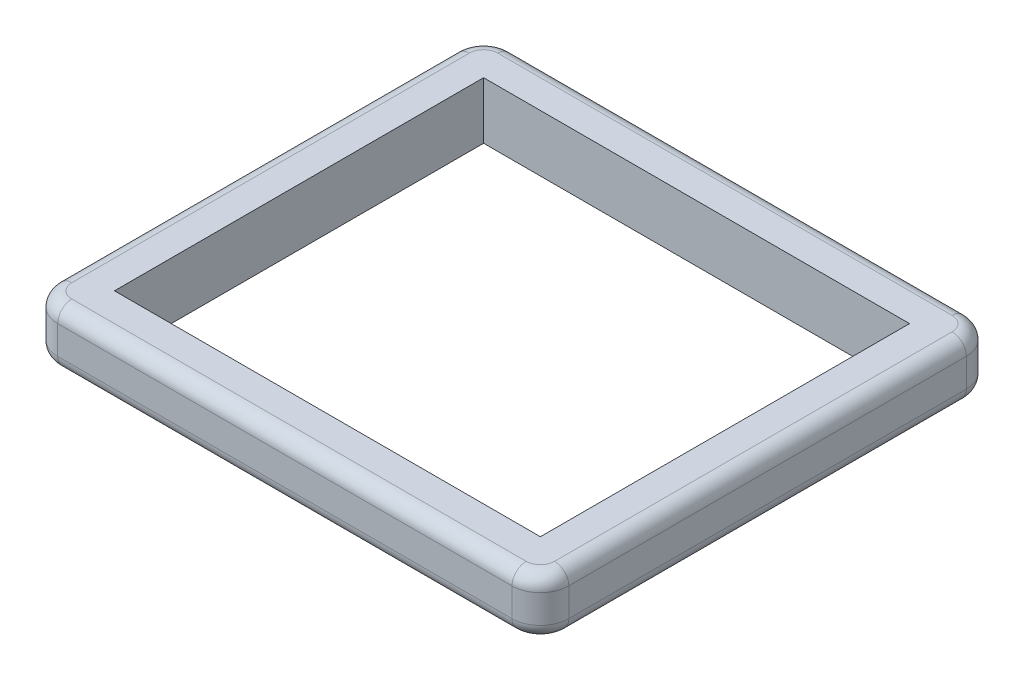
ISO-10303-21;
HEADER;
FILE_DESCRIPTION(('STEP AP214'),'2;1');
FILE_NAME('part.step','',(''),(''),'','','');
FILE_SCHEMA(('AUTOMOTIVE_DESIGN { 1 0 10303 214 1 1 1 1 }'));
ENDSEC;
DATA;
#1=APPLICATION_CONTEXT('core data for automotive mechanical design processes');
#2=APPLICATION_PROTOCOL_DEFINITION('international standard','automotive_design',2000,#1);
#3=PRODUCT_CONTEXT('',#1,'mechanical');
#4=PRODUCT('Part','Part','',(#3));
#5=PRODUCT_RELATED_PRODUCT_CATEGORY('part','',(#4));
#6=PRODUCT_DEFINITION_FORMATION('','',#4);
#7=PRODUCT_DEFINITION_CONTEXT('part definition',#1,'design');
#8=PRODUCT_DEFINITION('design','',#6,#7);
#9=PRODUCT_DEFINITION_SHAPE('','',#8);
#10=(LENGTH_UNIT() NAMED_UNIT(*) SI_UNIT(.MILLI.,.METRE.));
#11=(NAMED_UNIT(*) PLANE_ANGLE_UNIT() SI_UNIT($,.RADIAN.));
#12=(NAMED_UNIT(*) SI_UNIT($,.STERADIAN.) SOLID_ANGLE_UNIT());
#13=UNCERTAINTY_MEASURE_WITH_UNIT(LENGTH_MEASURE(1.E-05),#10,'distance_accuracy_value','');
#14=(GEOMETRIC_REPRESENTATION_CONTEXT(3) GLOBAL_UNCERTAINTY_ASSIGNED_CONTEXT((#13)) GLOBAL_UNIT_ASSIGNED_CONTEXT((#10,
#11,#12)) REPRESENTATION_CONTEXT('',''));
#15=CARTESIAN_POINT('',(0.,0.,0.));
#16=DIRECTION('',(0.,0.,1.));
#17=DIRECTION('',(1.,0.,0.));
#18=AXIS2_PLACEMENT_3D('',#15,#16,#17);
#19=CARTESIAN_POINT('',(0.,101.6,0.));
#20=DIRECTION('',(0.,1.,0.));
#21=DIRECTION('',(0.,0.,1.));
#22=AXIS2_PLACEMENT_3D('',#19,#20,#21);
#23=PLANE('',#22);
#24=DIRECTION('',(1.,0.,0.));
#25=VECTOR('',#24,1.);
#26=CARTESIAN_POINT('',(0.,101.6,0.));
#27=LINE('',#26,#25);
#28=CARTESIAN_POINT('',(0.,101.6,0.));
#29=VERTEX_POINT('',#28);
#30=CARTESIAN_POINT('',(762.,101.6,0.));
#31=VERTEX_POINT('',#30);
#32=EDGE_CURVE('E187',#29,#31,#27,.T.);
#33=ORIENTED_EDGE('',*,*,#32,.F.);
#34=DIRECTION('',(0.,0.,1.));
#35=VECTOR('',#34,1.);
#36=CARTESIAN_POINT('',(0.,101.6,0.));
#37=LINE('',#36,#35);
#38=CARTESIAN_POINT('',(-2.22044604925031E-13,101.6,-660.4));
#39=VERTEX_POINT('',#38);
#40=EDGE_CURVE('E177',#39,#29,#37,.T.);
#41=ORIENTED_EDGE('',*,*,#40,.F.);
#42=DIRECTION('',(-1.,0.,0.));
#43=VECTOR('',#42,1.);
#44=CARTESIAN_POINT('',(-2.22044604925031E-13,101.6,-660.4));
#45=LINE('',#44,#43);
#46=CARTESIAN_POINT('',(762.,101.6,-660.4));
#47=VERTEX_POINT('',#46);
#48=EDGE_CURVE('E203',#47,#39,#45,.T.);
#49=ORIENTED_EDGE('',*,*,#48,.F.);
#50=DIRECTION('',(0.,0.,-1.));
#51=VECTOR('',#50,1.);
#52=CARTESIAN_POINT('',(762.,101.6,0.));
#53=LINE('',#52,#51);
#54=EDGE_CURVE('E201',#31,#47,#53,.T.);
#55=ORIENTED_EDGE('',*,*,#54,.F.);
#56=EDGE_LOOP('',(#33,#41,#49,#55));
#57=FACE_BOUND('',#56,.T.);
#58=CARTESIAN_POINT('',(787.4,101.6,25.4));
#59=DIRECTION('',(0.,1.,0.));
#60=DIRECTION('',(0.,0.,1.));
#61=AXIS2_PLACEMENT_3D('',#58,#59,#60);
#62=CIRCLE('',#61,25.4);
#63=CARTESIAN_POINT('',(812.8,101.6,25.4));
#64=VERTEX_POINT('',#63);
#65=CARTESIAN_POINT('',(787.4,101.6,50.8));
#66=VERTEX_POINT('',#65);
#67=EDGE_CURVE('E288',#64,#66,#62,.F.);
#68=ORIENTED_EDGE('',*,*,#67,.F.);
#69=DIRECTION('',(0.,0.,-1.));
#70=VECTOR('',#69,1.);
#71=CARTESIAN_POINT('',(812.8,101.6,-736.6));
#72=LINE('',#71,#70);
#73=CARTESIAN_POINT('',(812.8,101.6,-685.8));
#74=VERTEX_POINT('',#73);
#75=EDGE_CURVE('E225',#64,#74,#72,.T.);
#76=ORIENTED_EDGE('',*,*,#75,.T.);
#77=CARTESIAN_POINT('',(787.4,101.6,-685.8));
#78=DIRECTION('',(0.,1.,0.));
#79=DIRECTION('',(0.,0.,1.));
#80=AXIS2_PLACEMENT_3D('',#77,#78,#79);
#81=CIRCLE('',#80,25.4);
#82=CARTESIAN_POINT('',(787.4,101.6,-711.2));
#83=VERTEX_POINT('',#82);
#84=EDGE_CURVE('E285',#83,#74,#81,.F.);
#85=ORIENTED_EDGE('',*,*,#84,.F.);
#86=DIRECTION('',(-1.,0.,0.));
#87=VECTOR('',#86,1.);
#88=CARTESIAN_POINT('',(-76.2,101.6,-711.2));
#89=LINE('',#88,#87);
#90=CARTESIAN_POINT('',(-25.4,101.6,-711.2));
#91=VERTEX_POINT('',#90);
#92=EDGE_CURVE('E222',#83,#91,#89,.T.);
#93=ORIENTED_EDGE('',*,*,#92,.T.);
#94=CARTESIAN_POINT('',(-25.4,101.6,-685.8));
#95=DIRECTION('',(0.,1.,0.));
#96=DIRECTION('',(0.,0.,1.));
#97=AXIS2_PLACEMENT_3D('',#94,#95,#96);
#98=CIRCLE('',#97,25.4);
#99=CARTESIAN_POINT('',(-50.8,101.6,-685.8));
#100=VERTEX_POINT('',#99);
#101=EDGE_CURVE('E279',#100,#91,#98,.F.);
#102=ORIENTED_EDGE('',*,*,#101,.F.);
#103=DIRECTION('',(0.,0.,1.));
#104=VECTOR('',#103,1.);
#105=CARTESIAN_POINT('',(-50.8,101.6,76.2));
#106=LINE('',#105,#104);
#107=CARTESIAN_POINT('',(-50.8,101.6,25.4));
#108=VERTEX_POINT('',#107);
#109=EDGE_CURVE('E195',#100,#108,#106,.T.);
#110=ORIENTED_EDGE('',*,*,#109,.T.);
#111=CARTESIAN_POINT('',(-25.4,101.6,25.4));
#112=DIRECTION('',(0.,1.,0.));
#113=DIRECTION('',(0.,0.,1.));
#114=AXIS2_PLACEMENT_3D('',#111,#112,#113);
#115=CIRCLE('',#114,25.4);
#116=CARTESIAN_POINT('',(-25.4,101.6,50.8));
#117=VERTEX_POINT('',#116);
#118=EDGE_CURVE('E282',#117,#108,#115,.F.);
#119=ORIENTED_EDGE('',*,*,#118,.F.);
#120=DIRECTION('',(1.,0.,0.));
#121=VECTOR('',#120,1.);
#122=CARTESIAN_POINT('',(838.2,101.6,50.8));
#123=LINE('',#122,#121);
#124=EDGE_CURVE('E228',#117,#66,#123,.T.);
#125=ORIENTED_EDGE('',*,*,#124,.T.);
#126=EDGE_LOOP('',(#68,#76,#85,#93,#102,#110,#119,#125));
#127=FACE_BOUND('',#126,.T.);
#128=ADVANCED_FACE('F36',(#57,#127),#23,.T.);
#129=CARTESIAN_POINT('',(0.,0.,0.));
#130=DIRECTION('',(0.,1.,0.));
#131=DIRECTION('',(0.,0.,1.));
#132=AXIS2_PLACEMENT_3D('',#129,#130,#131);
#133=PLANE('',#132);
#134=DIRECTION('',(0.,0.,1.));
#135=VECTOR('',#134,1.);
#136=CARTESIAN_POINT('',(0.,0.,0.));
#137=LINE('',#136,#135);
#138=CARTESIAN_POINT('',(-2.22044604925031E-13,0.,-660.4));
#139=VERTEX_POINT('',#138);
#140=CARTESIAN_POINT('',(0.,0.,0.));
#141=VERTEX_POINT('',#140);
#142=EDGE_CURVE('E207',#139,#141,#137,.T.);
#143=ORIENTED_EDGE('',*,*,#142,.T.);
#144=DIRECTION('',(1.,0.,0.));
#145=VECTOR('',#144,1.);
#146=CARTESIAN_POINT('',(0.,0.,0.));
#147=LINE('',#146,#145);
#148=CARTESIAN_POINT('',(762.,0.,0.));
#149=VERTEX_POINT('',#148);
#150=EDGE_CURVE('E194',#141,#149,#147,.T.);
#151=ORIENTED_EDGE('',*,*,#150,.T.);
#152=DIRECTION('',(0.,0.,-1.));
#153=VECTOR('',#152,1.);
#154=CARTESIAN_POINT('',(762.,0.,0.));
#155=LINE('',#154,#153);
#156=CARTESIAN_POINT('',(762.,0.,-660.4));
#157=VERTEX_POINT('',#156);
#158=EDGE_CURVE('E211',#149,#157,#155,.T.);
#159=ORIENTED_EDGE('',*,*,#158,.T.);
#160=DIRECTION('',(-1.,0.,0.));
#161=VECTOR('',#160,1.);
#162=CARTESIAN_POINT('',(-2.22044604925031E-13,0.,-660.4));
#163=LINE('',#162,#161);
#164=EDGE_CURVE('E188',#157,#139,#163,.T.);
#165=ORIENTED_EDGE('',*,*,#164,.T.);
#166=EDGE_LOOP('',(#143,#151,#159,#165));
#167=FACE_BOUND('',#166,.T.);
#168=CARTESIAN_POINT('',(787.4,0.,25.4));
#169=DIRECTION('',(0.,1.,0.));
#170=DIRECTION('',(0.,0.,1.));
#171=AXIS2_PLACEMENT_3D('',#168,#169,#170);
#172=CIRCLE('',#171,25.4);
#173=CARTESIAN_POINT('',(787.4,0.,50.8));
#174=VERTEX_POINT('',#173);
#175=CARTESIAN_POINT('',(812.8,0.,25.4));
#176=VERTEX_POINT('',#175);
#177=EDGE_CURVE('E272',#174,#176,#172,.T.);
#178=ORIENTED_EDGE('',*,*,#177,.F.);
#179=DIRECTION('',(1.,0.,0.));
#180=VECTOR('',#179,1.);
#181=CARTESIAN_POINT('',(0.,0.,50.8));
#182=LINE('',#181,#180);
#183=CARTESIAN_POINT('',(-25.4,0.,50.8));
#184=VERTEX_POINT('',#183);
#185=EDGE_CURVE('E247',#174,#184,#182,.F.);
#186=ORIENTED_EDGE('',*,*,#185,.T.);
#187=CARTESIAN_POINT('',(-25.4,0.,25.4));
#188=DIRECTION('',(0.,1.,0.));
#189=DIRECTION('',(0.,0.,1.));
#190=AXIS2_PLACEMENT_3D('',#187,#188,#189);
#191=CIRCLE('',#190,25.4);
#192=CARTESIAN_POINT('',(-50.8,0.,25.4));
#193=VERTEX_POINT('',#192);
#194=EDGE_CURVE('E267',#193,#184,#191,.T.);
#195=ORIENTED_EDGE('',*,*,#194,.F.);
#196=DIRECTION('',(0.,0.,1.));
#197=VECTOR('',#196,1.);
#198=CARTESIAN_POINT('',(-50.8,0.,0.));
#199=LINE('',#198,#197);
#200=CARTESIAN_POINT('',(-50.8,0.,-685.8));
#201=VERTEX_POINT('',#200);
#202=EDGE_CURVE('E250',#193,#201,#199,.F.);
#203=ORIENTED_EDGE('',*,*,#202,.T.);
#204=CARTESIAN_POINT('',(-25.4,0.,-685.8));
#205=DIRECTION('',(0.,1.,0.));
#206=DIRECTION('',(0.,0.,1.));
#207=AXIS2_PLACEMENT_3D('',#204,#205,#206);
#208=CIRCLE('',#207,25.4);
#209=CARTESIAN_POINT('',(-25.4,0.,-711.2));
#210=VERTEX_POINT('',#209);
#211=EDGE_CURVE('E265',#210,#201,#208,.T.);
#212=ORIENTED_EDGE('',*,*,#211,.F.);
#213=DIRECTION('',(-1.,0.,0.));
#214=VECTOR('',#213,1.);
#215=CARTESIAN_POINT('',(0.,0.,-711.2));
#216=LINE('',#215,#214);
#217=CARTESIAN_POINT('',(787.4,0.,-711.2));
#218=VERTEX_POINT('',#217);
#219=EDGE_CURVE('E253',#210,#218,#216,.F.);
#220=ORIENTED_EDGE('',*,*,#219,.T.);
#221=CARTESIAN_POINT('',(787.4,0.,-685.8));
#222=DIRECTION('',(0.,1.,0.));
#223=DIRECTION('',(0.,0.,1.));
#224=AXIS2_PLACEMENT_3D('',#221,#222,#223);
#225=CIRCLE('',#224,25.4);
#226=CARTESIAN_POINT('',(812.8,0.,-685.8));
#227=VERTEX_POINT('',#226);
#228=EDGE_CURVE('E269',#227,#218,#225,.T.);
#229=ORIENTED_EDGE('',*,*,#228,.F.);
#230=DIRECTION('',(0.,0.,-1.));
#231=VECTOR('',#230,1.);
#232=CARTESIAN_POINT('',(812.8,0.,0.));
#233=LINE('',#232,#231);
#234=EDGE_CURVE('E244',#227,#176,#233,.F.);
#235=ORIENTED_EDGE('',*,*,#234,.T.);
#236=EDGE_LOOP('',(#178,#186,#195,#203,#212,#220,#229,#235));
#237=FACE_BOUND('',#236,.T.);
#238=ADVANCED_FACE('F388',(#167,#237),#133,.F.);
#239=CARTESIAN_POINT('',(-76.2,101.6,76.2));
#240=DIRECTION('',(0.,0.,-1.));
#241=DIRECTION('',(-1.,0.,0.));
#242=AXIS2_PLACEMENT_3D('',#239,#240,#241);
#243=PLANE('',#242);
#244=DIRECTION('',(1.,0.,0.));
#245=VECTOR('',#244,1.);
#246=CARTESIAN_POINT('',(-76.2,76.2,76.2));
#247=LINE('',#246,#245);
#248=CARTESIAN_POINT('',(787.4,76.2,76.2));
#249=VERTEX_POINT('',#248);
#250=CARTESIAN_POINT('',(-25.4,76.2,76.2));
#251=VERTEX_POINT('',#250);
#252=EDGE_CURVE('E231',#249,#251,#247,.F.);
#253=ORIENTED_EDGE('',*,*,#252,.T.);
#254=DIRECTION('',(0.,-1.,0.));
#255=VECTOR('',#254,1.);
#256=CARTESIAN_POINT('',(-25.4,101.6,76.2));
#257=LINE('',#256,#255);
#258=CARTESIAN_POINT('',(-25.4,25.4,76.2));
#259=VERTEX_POINT('',#258);
#260=EDGE_CURVE('E329',#251,#259,#257,.T.);
#261=ORIENTED_EDGE('',*,*,#260,.T.);
#262=DIRECTION('',(1.,0.,0.));
#263=VECTOR('',#262,1.);
#264=CARTESIAN_POINT('',(-76.2,25.4,76.2));
#265=LINE('',#264,#263);
#266=CARTESIAN_POINT('',(787.4,25.4,76.2));
#267=VERTEX_POINT('',#266);
#268=EDGE_CURVE('E259',#259,#267,#265,.T.);
#269=ORIENTED_EDGE('',*,*,#268,.T.);
#270=DIRECTION('',(0.,-1.,0.));
#271=VECTOR('',#270,1.);
#272=CARTESIAN_POINT('',(787.4,101.6,76.2));
#273=LINE('',#272,#271);
#274=EDGE_CURVE('E327',#267,#249,#273,.F.);
#275=ORIENTED_EDGE('',*,*,#274,.T.);
#276=EDGE_LOOP('',(#253,#261,#269,#275));
#277=FACE_BOUND('',#276,.T.);
#278=ADVANCED_FACE('F453',(#277),#243,.F.);
#279=CARTESIAN_POINT('',(838.2,101.6,76.2));
#280=DIRECTION('',(-1.,0.,0.));
#281=DIRECTION('',(0.,0.,1.));
#282=AXIS2_PLACEMENT_3D('',#279,#280,#281);
#283=PLANE('',#282);
#284=DIRECTION('',(0.,0.,-1.));
#285=VECTOR('',#284,1.);
#286=CARTESIAN_POINT('',(838.2,25.4,76.2));
#287=LINE('',#286,#285);
#288=CARTESIAN_POINT('',(838.2,25.4,25.4));
#289=VERTEX_POINT('',#288);
#290=CARTESIAN_POINT('',(838.2,25.4,-685.8));
#291=VERTEX_POINT('',#290);
#292=EDGE_CURVE('E262',#289,#291,#287,.T.);
#293=ORIENTED_EDGE('',*,*,#292,.T.);
#294=DIRECTION('',(0.,-1.,0.));
#295=VECTOR('',#294,1.);
#296=CARTESIAN_POINT('',(838.2,101.6,-685.8));
#297=LINE('',#296,#295);
#298=CARTESIAN_POINT('',(838.2,76.2,-685.8));
#299=VERTEX_POINT('',#298);
#300=EDGE_CURVE('E11',#291,#299,#297,.F.);
#301=ORIENTED_EDGE('',*,*,#300,.T.);
#302=DIRECTION('',(0.,0.,-1.));
#303=VECTOR('',#302,1.);
#304=CARTESIAN_POINT('',(838.2,76.2,76.2));
#305=LINE('',#304,#303);
#306=CARTESIAN_POINT('',(838.2,76.2,25.4));
#307=VERTEX_POINT('',#306);
#308=EDGE_CURVE('E234',#299,#307,#305,.F.);
#309=ORIENTED_EDGE('',*,*,#308,.T.);
#310=DIRECTION('',(0.,-1.,0.));
#311=VECTOR('',#310,1.);
#312=CARTESIAN_POINT('',(838.2,101.6,25.4));
#313=LINE('',#312,#311);
#314=EDGE_CURVE('E45',#307,#289,#313,.T.);
#315=ORIENTED_EDGE('',*,*,#314,.T.);
#316=EDGE_LOOP('',(#293,#301,#309,#315));
#317=FACE_BOUND('',#316,.T.);
#318=ADVANCED_FACE('F429',(#317),#283,.F.);
#319=CARTESIAN_POINT('',(-76.2,101.6,-736.6));
#320=DIRECTION('',(0.,0.,1.));
#321=DIRECTION('',(1.,0.,0.));
#322=AXIS2_PLACEMENT_3D('',#319,#320,#321);
#323=PLANE('',#322);
#324=DIRECTION('',(-1.,0.,0.));
#325=VECTOR('',#324,1.);
#326=CARTESIAN_POINT('',(-76.2,25.4,-736.6));
#327=LINE('',#326,#325);
#328=CARTESIAN_POINT('',(787.4,25.4,-736.6));
#329=VERTEX_POINT('',#328);
#330=CARTESIAN_POINT('',(-25.4,25.4,-736.6));
#331=VERTEX_POINT('',#330);
#332=EDGE_CURVE('E242',#329,#331,#327,.T.);
#333=ORIENTED_EDGE('',*,*,#332,.T.);
#334=DIRECTION('',(0.,-1.,0.));
#335=VECTOR('',#334,1.);
#336=CARTESIAN_POINT('',(-25.4,101.6,-736.6));
#337=LINE('',#336,#335);
#338=CARTESIAN_POINT('',(-25.4,76.2,-736.6));
#339=VERTEX_POINT('',#338);
#340=EDGE_CURVE('E60',#331,#339,#337,.F.);
#341=ORIENTED_EDGE('',*,*,#340,.T.);
#342=DIRECTION('',(-1.,0.,0.));
#343=VECTOR('',#342,1.);
#344=CARTESIAN_POINT('',(838.2,76.2,-736.6));
#345=LINE('',#344,#343);
#346=CARTESIAN_POINT('',(787.4,76.2,-736.6));
#347=VERTEX_POINT('',#346);
#348=EDGE_CURVE('E237',#339,#347,#345,.F.);
#349=ORIENTED_EDGE('',*,*,#348,.T.);
#350=DIRECTION('',(0.,-1.,0.));
#351=VECTOR('',#350,1.);
#352=CARTESIAN_POINT('',(787.4,101.6,-736.6));
#353=LINE('',#352,#351);
#354=EDGE_CURVE('E324',#347,#329,#353,.T.);
#355=ORIENTED_EDGE('',*,*,#354,.T.);
#356=EDGE_LOOP('',(#333,#341,#349,#355));
#357=FACE_BOUND('',#356,.T.);
#358=ADVANCED_FACE('F376',(#357),#323,.F.);
#359=CARTESIAN_POINT('',(-76.2,101.6,76.2));
#360=DIRECTION('',(1.,0.,0.));
#361=DIRECTION('',(0.,0.,-1.));
#362=AXIS2_PLACEMENT_3D('',#359,#360,#361);
#363=PLANE('',#362);
#364=DIRECTION('',(0.,0.,1.));
#365=VECTOR('',#364,1.);
#366=CARTESIAN_POINT('',(-76.2,76.2,-736.6));
#367=LINE('',#366,#365);
#368=CARTESIAN_POINT('',(-76.2,76.2,25.4));
#369=VERTEX_POINT('',#368);
#370=CARTESIAN_POINT('',(-76.2,76.2,-685.8));
#371=VERTEX_POINT('',#370);
#372=EDGE_CURVE('E239',#369,#371,#367,.F.);
#373=ORIENTED_EDGE('',*,*,#372,.T.);
#374=DIRECTION('',(0.,-1.,0.));
#375=VECTOR('',#374,1.);
#376=CARTESIAN_POINT('',(-76.2,101.6,-685.8));
#377=LINE('',#376,#375);
#378=CARTESIAN_POINT('',(-76.2,25.4,-685.8));
#379=VERTEX_POINT('',#378);
#380=EDGE_CURVE('E322',#371,#379,#377,.T.);
#381=ORIENTED_EDGE('',*,*,#380,.T.);
#382=DIRECTION('',(0.,0.,1.));
#383=VECTOR('',#382,1.);
#384=CARTESIAN_POINT('',(-76.2,25.4,76.2));
#385=LINE('',#384,#383);
#386=CARTESIAN_POINT('',(-76.2,25.4,25.4));
#387=VERTEX_POINT('',#386);
#388=EDGE_CURVE('E256',#379,#387,#385,.T.);
#389=ORIENTED_EDGE('',*,*,#388,.T.);
#390=DIRECTION('',(0.,-1.,0.));
#391=VECTOR('',#390,1.);
#392=CARTESIAN_POINT('',(-76.2,101.6,25.4));
#393=LINE('',#392,#391);
#394=EDGE_CURVE('E320',#387,#369,#393,.F.);
#395=ORIENTED_EDGE('',*,*,#394,.T.);
#396=EDGE_LOOP('',(#373,#381,#389,#395));
#397=FACE_BOUND('',#396,.T.);
#398=ADVANCED_FACE('F406',(#397),#363,.F.);
#399=CARTESIAN_POINT('',(0.,101.6,0.));
#400=DIRECTION('',(1.,0.,0.));
#401=DIRECTION('',(0.,0.,-1.));
#402=AXIS2_PLACEMENT_3D('',#399,#400,#401);
#403=PLANE('',#402);
#404=ORIENTED_EDGE('',*,*,#142,.F.);
#405=DIRECTION('',(0.,-1.,0.));
#406=VECTOR('',#405,1.);
#407=CARTESIAN_POINT('',(-2.22044604925031E-13,101.6,-660.4));
#408=LINE('',#407,#406);
#409=EDGE_CURVE('E183',#39,#139,#408,.T.);
#410=ORIENTED_EDGE('',*,*,#409,.F.);
#411=ORIENTED_EDGE('',*,*,#40,.T.);
#412=DIRECTION('',(0.,-1.,0.));
#413=VECTOR('',#412,1.);
#414=CARTESIAN_POINT('',(0.,101.6,0.));
#415=LINE('',#414,#413);
#416=EDGE_CURVE('E180',#29,#141,#415,.T.);
#417=ORIENTED_EDGE('',*,*,#416,.T.);
#418=EDGE_LOOP('',(#404,#410,#411,#417));
#419=FACE_BOUND('',#418,.T.);
#420=ADVANCED_FACE('F179',(#419),#403,.T.);
#421=CARTESIAN_POINT('',(0.,101.6,0.));
#422=DIRECTION('',(0.,0.,-1.));
#423=DIRECTION('',(-1.,0.,0.));
#424=AXIS2_PLACEMENT_3D('',#421,#422,#423);
#425=PLANE('',#424);
#426=ORIENTED_EDGE('',*,*,#150,.F.);
#427=ORIENTED_EDGE('',*,*,#416,.F.);
#428=ORIENTED_EDGE('',*,*,#32,.T.);
#429=DIRECTION('',(0.,-1.,0.));
#430=VECTOR('',#429,1.);
#431=CARTESIAN_POINT('',(762.,101.6,0.));
#432=LINE('',#431,#430);
#433=EDGE_CURVE('E196',#31,#149,#432,.T.);
#434=ORIENTED_EDGE('',*,*,#433,.T.);
#435=EDGE_LOOP('',(#426,#427,#428,#434));
#436=FACE_BOUND('',#435,.T.);
#437=ADVANCED_FACE('F191',(#436),#425,.T.);
#438=CARTESIAN_POINT('',(762.,101.6,0.));
#439=DIRECTION('',(-1.,0.,0.));
#440=DIRECTION('',(0.,0.,1.));
#441=AXIS2_PLACEMENT_3D('',#438,#439,#440);
#442=PLANE('',#441);
#443=ORIENTED_EDGE('',*,*,#158,.F.);
#444=ORIENTED_EDGE('',*,*,#433,.F.);
#445=ORIENTED_EDGE('',*,*,#54,.T.);
#446=DIRECTION('',(0.,-1.,0.));
#447=VECTOR('',#446,1.);
#448=CARTESIAN_POINT('',(762.,101.6,-660.4));
#449=LINE('',#448,#447);
#450=EDGE_CURVE('E217',#47,#157,#449,.T.);
#451=ORIENTED_EDGE('',*,*,#450,.T.);
#452=EDGE_LOOP('',(#443,#444,#445,#451));
#453=FACE_BOUND('',#452,.T.);
#454=ADVANCED_FACE('F648',(#453),#442,.T.);
#455=CARTESIAN_POINT('',(-2.22044604925031E-13,101.6,-660.4));
#456=DIRECTION('',(0.,0.,1.));
#457=DIRECTION('',(1.,0.,0.));
#458=AXIS2_PLACEMENT_3D('',#455,#456,#457);
#459=PLANE('',#458);
#460=ORIENTED_EDGE('',*,*,#164,.F.);
#461=ORIENTED_EDGE('',*,*,#450,.F.);
#462=ORIENTED_EDGE('',*,*,#48,.T.);
#463=ORIENTED_EDGE('',*,*,#409,.T.);
#464=EDGE_LOOP('',(#460,#461,#462,#463));
#465=FACE_BOUND('',#464,.T.);
#466=ADVANCED_FACE('F477',(#465),#459,.T.);
#467=CARTESIAN_POINT('',(0.,76.2,-711.2));
#468=DIRECTION('',(1.,0.,0.));
#469=DIRECTION('',(0.,0.,-1.));
#470=AXIS2_PLACEMENT_3D('',#467,#468,#469);
#471=CYLINDRICAL_SURFACE('',#470,25.4);
#472=ORIENTED_EDGE('',*,*,#348,.F.);
#473=CARTESIAN_POINT('',(-25.4,76.2,-711.2));
#474=DIRECTION('',(1.,0.,0.));
#475=DIRECTION('',(0.,0.,-1.));
#476=AXIS2_PLACEMENT_3D('',#473,#474,#475);
#477=CIRCLE('',#476,25.4);
#478=EDGE_CURVE('E318',#339,#91,#477,.T.);
#479=ORIENTED_EDGE('',*,*,#478,.T.);
#480=ORIENTED_EDGE('',*,*,#92,.F.);
#481=CARTESIAN_POINT('',(787.4,76.2,-711.2));
#482=DIRECTION('',(-1.,0.,0.));
#483=DIRECTION('',(0.,0.,1.));
#484=AXIS2_PLACEMENT_3D('',#481,#482,#483);
#485=CIRCLE('',#484,25.4);
#486=EDGE_CURVE('E53',#83,#347,#485,.T.);
#487=ORIENTED_EDGE('',*,*,#486,.T.);
#488=EDGE_LOOP('',(#472,#479,#480,#487));
#489=FACE_BOUND('',#488,.T.);
#490=ADVANCED_FACE('F362',(#489),#471,.T.);
#491=CARTESIAN_POINT('',(-50.8,76.2,0.));
#492=DIRECTION('',(0.,0.,-1.));
#493=DIRECTION('',(-1.,0.,0.));
#494=AXIS2_PLACEMENT_3D('',#491,#492,#493);
#495=CYLINDRICAL_SURFACE('',#494,25.4);
#496=ORIENTED_EDGE('',*,*,#372,.F.);
#497=CARTESIAN_POINT('',(-50.8,76.2,25.4));
#498=DIRECTION('',(0.,0.,-1.));
#499=DIRECTION('',(-1.,0.,0.));
#500=AXIS2_PLACEMENT_3D('',#497,#498,#499);
#501=CIRCLE('',#500,25.4);
#502=EDGE_CURVE('E310',#369,#108,#501,.T.);
#503=ORIENTED_EDGE('',*,*,#502,.T.);
#504=ORIENTED_EDGE('',*,*,#109,.F.);
#505=CARTESIAN_POINT('',(-50.8,76.2,-685.8));
#506=DIRECTION('',(0.,0.,1.));
#507=DIRECTION('',(1.,0.,0.));
#508=AXIS2_PLACEMENT_3D('',#505,#506,#507);
#509=CIRCLE('',#508,25.4);
#510=EDGE_CURVE('E308',#100,#371,#509,.T.);
#511=ORIENTED_EDGE('',*,*,#510,.T.);
#512=EDGE_LOOP('',(#496,#503,#504,#511));
#513=FACE_BOUND('',#512,.T.);
#514=ADVANCED_FACE('F409',(#513),#495,.T.);
#515=CARTESIAN_POINT('',(812.8,76.2,0.));
#516=DIRECTION('',(0.,0.,1.));
#517=DIRECTION('',(1.,0.,0.));
#518=AXIS2_PLACEMENT_3D('',#515,#516,#517);
#519=CYLINDRICAL_SURFACE('',#518,25.4);
#520=ORIENTED_EDGE('',*,*,#308,.F.);
#521=CARTESIAN_POINT('',(812.8,76.2,-685.8));
#522=DIRECTION('',(0.,0.,1.));
#523=DIRECTION('',(1.,0.,0.));
#524=AXIS2_PLACEMENT_3D('',#521,#522,#523);
#525=CIRCLE('',#524,25.4);
#526=EDGE_CURVE('E301',#299,#74,#525,.T.);
#527=ORIENTED_EDGE('',*,*,#526,.T.);
#528=ORIENTED_EDGE('',*,*,#75,.F.);
#529=CARTESIAN_POINT('',(812.8,76.2,25.4));
#530=DIRECTION('',(0.,0.,-1.));
#531=DIRECTION('',(-1.,0.,0.));
#532=AXIS2_PLACEMENT_3D('',#529,#530,#531);
#533=CIRCLE('',#532,25.4);
#534=EDGE_CURVE('E299',#64,#307,#533,.T.);
#535=ORIENTED_EDGE('',*,*,#534,.T.);
#536=EDGE_LOOP('',(#520,#527,#528,#535));
#537=FACE_BOUND('',#536,.T.);
#538=ADVANCED_FACE('F469',(#537),#519,.T.);
#539=CARTESIAN_POINT('',(0.,76.2,50.8));
#540=DIRECTION('',(-1.,0.,0.));
#541=DIRECTION('',(0.,0.,1.));
#542=AXIS2_PLACEMENT_3D('',#539,#540,#541);
#543=CYLINDRICAL_SURFACE('',#542,25.4);
#544=ORIENTED_EDGE('',*,*,#252,.F.);
#545=CARTESIAN_POINT('',(787.4,76.2,50.8));
#546=DIRECTION('',(-1.,0.,0.));
#547=DIRECTION('',(0.,0.,1.));
#548=AXIS2_PLACEMENT_3D('',#545,#546,#547);
#549=CIRCLE('',#548,25.4);
#550=EDGE_CURVE('E293',#249,#66,#549,.T.);
#551=ORIENTED_EDGE('',*,*,#550,.T.);
#552=ORIENTED_EDGE('',*,*,#124,.F.);
#553=CARTESIAN_POINT('',(-25.4,76.2,50.8));
#554=DIRECTION('',(1.,0.,0.));
#555=DIRECTION('',(0.,0.,-1.));
#556=AXIS2_PLACEMENT_3D('',#553,#554,#555);
#557=CIRCLE('',#556,25.4);
#558=EDGE_CURVE('E291',#117,#251,#557,.T.);
#559=ORIENTED_EDGE('',*,*,#558,.T.);
#560=EDGE_LOOP('',(#544,#551,#552,#559));
#561=FACE_BOUND('',#560,.T.);
#562=ADVANCED_FACE('F416',(#561),#543,.T.);
#563=CARTESIAN_POINT('',(-76.2,25.4,50.8));
#564=DIRECTION('',(1.,0.,0.));
#565=DIRECTION('',(0.,0.,-1.));
#566=AXIS2_PLACEMENT_3D('',#563,#564,#565);
#567=CYLINDRICAL_SURFACE('',#566,25.4);
#568=ORIENTED_EDGE('',*,*,#268,.F.);
#569=CARTESIAN_POINT('',(-25.4,25.4,50.8));
#570=DIRECTION('',(1.,0.,0.));
#571=DIRECTION('',(0.,0.,-1.));
#572=AXIS2_PLACEMENT_3D('',#569,#570,#571);
#573=CIRCLE('',#572,25.4);
#574=EDGE_CURVE('E305',#259,#184,#573,.T.);
#575=ORIENTED_EDGE('',*,*,#574,.T.);
#576=ORIENTED_EDGE('',*,*,#185,.F.);
#577=CARTESIAN_POINT('',(787.4,25.4,50.8));
#578=DIRECTION('',(-1.,0.,0.));
#579=DIRECTION('',(0.,0.,1.));
#580=AXIS2_PLACEMENT_3D('',#577,#578,#579);
#581=CIRCLE('',#580,25.4);
#582=EDGE_CURVE('E303',#174,#267,#581,.T.);
#583=ORIENTED_EDGE('',*,*,#582,.T.);
#584=EDGE_LOOP('',(#568,#575,#576,#583));
#585=FACE_BOUND('',#584,.T.);
#586=ADVANCED_FACE('F395',(#585),#567,.T.);
#587=CARTESIAN_POINT('',(812.8,25.4,76.2));
#588=DIRECTION('',(0.,0.,-1.));
#589=DIRECTION('',(-1.,0.,0.));
#590=AXIS2_PLACEMENT_3D('',#587,#588,#589);
#591=CYLINDRICAL_SURFACE('',#590,25.4);
#592=ORIENTED_EDGE('',*,*,#292,.F.);
#593=CARTESIAN_POINT('',(812.8,25.4,25.4));
#594=DIRECTION('',(0.,0.,-1.));
#595=DIRECTION('',(-1.,0.,0.));
#596=AXIS2_PLACEMENT_3D('',#593,#594,#595);
#597=CIRCLE('',#596,25.4);
#598=EDGE_CURVE('E277',#289,#176,#597,.T.);
#599=ORIENTED_EDGE('',*,*,#598,.T.);
#600=ORIENTED_EDGE('',*,*,#234,.F.);
#601=CARTESIAN_POINT('',(812.8,25.4,-685.8));
#602=DIRECTION('',(0.,0.,1.));
#603=DIRECTION('',(1.,0.,0.));
#604=AXIS2_PLACEMENT_3D('',#601,#602,#603);
#605=CIRCLE('',#604,25.4);
#606=EDGE_CURVE('E275',#227,#291,#605,.T.);
#607=ORIENTED_EDGE('',*,*,#606,.T.);
#608=EDGE_LOOP('',(#592,#599,#600,#607));
#609=FACE_BOUND('',#608,.T.);
#610=ADVANCED_FACE('F432',(#609),#591,.T.);
#611=CARTESIAN_POINT('',(-50.8,25.4,76.2));
#612=DIRECTION('',(0.,0.,1.));
#613=DIRECTION('',(1.,0.,0.));
#614=AXIS2_PLACEMENT_3D('',#611,#612,#613);
#615=CYLINDRICAL_SURFACE('',#614,25.4);
#616=ORIENTED_EDGE('',*,*,#388,.F.);
#617=CARTESIAN_POINT('',(-50.8,25.4,-685.8));
#618=DIRECTION('',(0.,0.,1.));
#619=DIRECTION('',(1.,0.,0.));
#620=AXIS2_PLACEMENT_3D('',#617,#618,#619);
#621=CIRCLE('',#620,25.4);
#622=EDGE_CURVE('E314',#379,#201,#621,.T.);
#623=ORIENTED_EDGE('',*,*,#622,.T.);
#624=ORIENTED_EDGE('',*,*,#202,.F.);
#625=CARTESIAN_POINT('',(-50.8,25.4,25.4));
#626=DIRECTION('',(0.,0.,-1.));
#627=DIRECTION('',(-1.,0.,0.));
#628=AXIS2_PLACEMENT_3D('',#625,#626,#627);
#629=CIRCLE('',#628,25.4);
#630=EDGE_CURVE('E312',#193,#387,#629,.T.);
#631=ORIENTED_EDGE('',*,*,#630,.T.);
#632=EDGE_LOOP('',(#616,#623,#624,#631));
#633=FACE_BOUND('',#632,.T.);
#634=ADVANCED_FACE('F385',(#633),#615,.T.);
#635=CARTESIAN_POINT('',(-76.2,25.4,-711.2));
#636=DIRECTION('',(-1.,0.,0.));
#637=DIRECTION('',(0.,0.,1.));
#638=AXIS2_PLACEMENT_3D('',#635,#636,#637);
#639=CYLINDRICAL_SURFACE('',#638,25.4);
#640=ORIENTED_EDGE('',*,*,#332,.F.);
#641=CARTESIAN_POINT('',(787.4,25.4,-711.2));
#642=DIRECTION('',(-1.,0.,0.));
#643=DIRECTION('',(0.,0.,1.));
#644=AXIS2_PLACEMENT_3D('',#641,#642,#643);
#645=CIRCLE('',#644,25.4);
#646=EDGE_CURVE('E297',#329,#218,#645,.T.);
#647=ORIENTED_EDGE('',*,*,#646,.T.);
#648=ORIENTED_EDGE('',*,*,#219,.F.);
#649=CARTESIAN_POINT('',(-25.4,25.4,-711.2));
#650=DIRECTION('',(1.,0.,0.));
#651=DIRECTION('',(0.,0.,-1.));
#652=AXIS2_PLACEMENT_3D('',#649,#650,#651);
#653=CIRCLE('',#652,25.4);
#654=EDGE_CURVE('E295',#210,#331,#653,.T.);
#655=ORIENTED_EDGE('',*,*,#654,.T.);
#656=EDGE_LOOP('',(#640,#647,#648,#655));
#657=FACE_BOUND('',#656,.T.);
#658=ADVANCED_FACE('F378',(#657),#639,.T.);
#659=CARTESIAN_POINT('',(787.4,76.2,25.4));
#660=DIRECTION('',(0.,1.,0.));
#661=DIRECTION('',(0.,0.,1.));
#662=AXIS2_PLACEMENT_3D('',#659,#660,#661);
#663=DEGENERATE_TOROIDAL_SURFACE('',#662,25.4,25.4,.T.);
#664=ORIENTED_EDGE('',*,*,#67,.T.);
#665=ORIENTED_EDGE('',*,*,#550,.F.);
#666=CARTESIAN_POINT('',(787.4,76.2,25.4));
#667=DIRECTION('',(0.,1.,0.));
#668=DIRECTION('',(0.,0.,1.));
#669=AXIS2_PLACEMENT_3D('',#666,#667,#668);
#670=CIRCLE('',#669,50.8);
#671=EDGE_CURVE('E209',#307,#249,#670,.F.);
#672=ORIENTED_EDGE('',*,*,#671,.F.);
#673=ORIENTED_EDGE('',*,*,#534,.F.);
#674=EDGE_LOOP('',(#664,#665,#672,#673));
#675=FACE_BOUND('',#674,.T.);
#676=ADVANCED_FACE('F420',(#675),#663,.T.);
#677=CARTESIAN_POINT('',(787.4,101.6,25.4));
#678=DIRECTION('',(0.,-1.,0.));
#679=DIRECTION('',(0.,0.,-1.));
#680=AXIS2_PLACEMENT_3D('',#677,#678,#679);
#681=CYLINDRICAL_SURFACE('',#680,50.8);
#682=ORIENTED_EDGE('',*,*,#671,.T.);
#683=ORIENTED_EDGE('',*,*,#274,.F.);
#684=CARTESIAN_POINT('',(787.4,25.4,25.4));
#685=DIRECTION('',(0.,1.,0.));
#686=DIRECTION('',(0.,0.,1.));
#687=AXIS2_PLACEMENT_3D('',#684,#685,#686);
#688=CIRCLE('',#687,50.8);
#689=EDGE_CURVE('E332',#289,#267,#688,.F.);
#690=ORIENTED_EDGE('',*,*,#689,.F.);
#691=ORIENTED_EDGE('',*,*,#314,.F.);
#692=EDGE_LOOP('',(#682,#683,#690,#691));
#693=FACE_BOUND('',#692,.T.);
#694=ADVANCED_FACE('F424',(#693),#681,.T.);
#695=CARTESIAN_POINT('',(787.4,25.4,25.4));
#696=DIRECTION('',(0.,1.,0.));
#697=DIRECTION('',(0.,0.,1.));
#698=AXIS2_PLACEMENT_3D('',#695,#696,#697);
#699=DEGENERATE_TOROIDAL_SURFACE('',#698,25.4,25.4,.T.);
#700=ORIENTED_EDGE('',*,*,#582,.F.);
#701=ORIENTED_EDGE('',*,*,#177,.T.);
#702=ORIENTED_EDGE('',*,*,#598,.F.);
#703=ORIENTED_EDGE('',*,*,#689,.T.);
#704=EDGE_LOOP('',(#700,#701,#702,#703));
#705=FACE_BOUND('',#704,.T.);
#706=ADVANCED_FACE('F438',(#705),#699,.T.);
#707=CARTESIAN_POINT('',(787.4,76.2,-685.8));
#708=DIRECTION('',(0.,1.,0.));
#709=DIRECTION('',(0.,0.,1.));
#710=AXIS2_PLACEMENT_3D('',#707,#708,#709);
#711=DEGENERATE_TOROIDAL_SURFACE('',#710,25.4,25.4,.T.);
#712=ORIENTED_EDGE('',*,*,#84,.T.);
#713=ORIENTED_EDGE('',*,*,#526,.F.);
#714=CARTESIAN_POINT('',(787.4,76.2,-685.8));
#715=DIRECTION('',(0.,1.,0.));
#716=DIRECTION('',(0.,0.,1.));
#717=AXIS2_PLACEMENT_3D('',#714,#715,#716);
#718=CIRCLE('',#717,50.8);
#719=EDGE_CURVE('E335',#347,#299,#718,.F.);
#720=ORIENTED_EDGE('',*,*,#719,.F.);
#721=ORIENTED_EDGE('',*,*,#486,.F.);
#722=EDGE_LOOP('',(#712,#713,#720,#721));
#723=FACE_BOUND('',#722,.T.);
#724=ADVANCED_FACE('F367',(#723),#711,.T.);
#725=CARTESIAN_POINT('',(787.4,101.6,-685.8));
#726=DIRECTION('',(0.,-1.,0.));
#727=DIRECTION('',(0.,0.,-1.));
#728=AXIS2_PLACEMENT_3D('',#725,#726,#727);
#729=CYLINDRICAL_SURFACE('',#728,50.8);
#730=ORIENTED_EDGE('',*,*,#719,.T.);
#731=ORIENTED_EDGE('',*,*,#300,.F.);
#732=CARTESIAN_POINT('',(787.4,25.4,-685.8));
#733=DIRECTION('',(0.,1.,0.));
#734=DIRECTION('',(0.,0.,1.));
#735=AXIS2_PLACEMENT_3D('',#732,#733,#734);
#736=CIRCLE('',#735,50.8);
#737=EDGE_CURVE('E338',#329,#291,#736,.F.);
#738=ORIENTED_EDGE('',*,*,#737,.F.);
#739=ORIENTED_EDGE('',*,*,#354,.F.);
#740=EDGE_LOOP('',(#730,#731,#738,#739));
#741=FACE_BOUND('',#740,.T.);
#742=ADVANCED_FACE('F373',(#741),#729,.T.);
#743=CARTESIAN_POINT('',(787.4,25.4,-685.8));
#744=DIRECTION('',(0.,1.,0.));
#745=DIRECTION('',(0.,0.,1.));
#746=AXIS2_PLACEMENT_3D('',#743,#744,#745);
#747=DEGENERATE_TOROIDAL_SURFACE('',#746,25.4,25.4,.T.);
#748=ORIENTED_EDGE('',*,*,#606,.F.);
#749=ORIENTED_EDGE('',*,*,#228,.T.);
#750=ORIENTED_EDGE('',*,*,#646,.F.);
#751=ORIENTED_EDGE('',*,*,#737,.T.);
#752=EDGE_LOOP('',(#748,#749,#750,#751));
#753=FACE_BOUND('',#752,.T.);
#754=ADVANCED_FACE('F436',(#753),#747,.T.);
#755=CARTESIAN_POINT('',(-25.4,76.2,25.4));
#756=DIRECTION('',(0.,1.,0.));
#757=DIRECTION('',(0.,0.,1.));
#758=AXIS2_PLACEMENT_3D('',#755,#756,#757);
#759=DEGENERATE_TOROIDAL_SURFACE('',#758,25.4,25.4,.T.);
#760=ORIENTED_EDGE('',*,*,#118,.T.);
#761=ORIENTED_EDGE('',*,*,#502,.F.);
#762=CARTESIAN_POINT('',(-25.4,76.2,25.4));
#763=DIRECTION('',(0.,1.,0.));
#764=DIRECTION('',(0.,0.,1.));
#765=AXIS2_PLACEMENT_3D('',#762,#763,#764);
#766=CIRCLE('',#765,50.8);
#767=EDGE_CURVE('E341',#251,#369,#766,.F.);
#768=ORIENTED_EDGE('',*,*,#767,.F.);
#769=ORIENTED_EDGE('',*,*,#558,.F.);
#770=EDGE_LOOP('',(#760,#761,#768,#769));
#771=FACE_BOUND('',#770,.T.);
#772=ADVANCED_FACE('F411',(#771),#759,.T.);
#773=CARTESIAN_POINT('',(-25.4,101.6,25.4));
#774=DIRECTION('',(0.,-1.,0.));
#775=DIRECTION('',(0.,0.,-1.));
#776=AXIS2_PLACEMENT_3D('',#773,#774,#775);
#777=CYLINDRICAL_SURFACE('',#776,50.8);
#778=ORIENTED_EDGE('',*,*,#767,.T.);
#779=ORIENTED_EDGE('',*,*,#394,.F.);
#780=CARTESIAN_POINT('',(-25.4,25.4,25.4));
#781=DIRECTION('',(0.,1.,0.));
#782=DIRECTION('',(0.,0.,1.));
#783=AXIS2_PLACEMENT_3D('',#780,#781,#782);
#784=CIRCLE('',#783,50.8);
#785=EDGE_CURVE('E344',#259,#387,#784,.F.);
#786=ORIENTED_EDGE('',*,*,#785,.F.);
#787=ORIENTED_EDGE('',*,*,#260,.F.);
#788=EDGE_LOOP('',(#778,#779,#786,#787));
#789=FACE_BOUND('',#788,.T.);
#790=ADVANCED_FACE('F402',(#789),#777,.T.);
#791=CARTESIAN_POINT('',(-25.4,25.4,25.4));
#792=DIRECTION('',(0.,1.,0.));
#793=DIRECTION('',(0.,0.,1.));
#794=AXIS2_PLACEMENT_3D('',#791,#792,#793);
#795=DEGENERATE_TOROIDAL_SURFACE('',#794,25.4,25.4,.T.);
#796=ORIENTED_EDGE('',*,*,#574,.F.);
#797=ORIENTED_EDGE('',*,*,#785,.T.);
#798=ORIENTED_EDGE('',*,*,#630,.F.);
#799=ORIENTED_EDGE('',*,*,#194,.T.);
#800=EDGE_LOOP('',(#796,#797,#798,#799));
#801=FACE_BOUND('',#800,.T.);
#802=ADVANCED_FACE('F392',(#801),#795,.T.);
#803=CARTESIAN_POINT('',(-25.4,76.2,-685.8));
#804=DIRECTION('',(0.,1.,0.));
#805=DIRECTION('',(0.,0.,1.));
#806=AXIS2_PLACEMENT_3D('',#803,#804,#805);
#807=DEGENERATE_TOROIDAL_SURFACE('',#806,25.4,25.4,.T.);
#808=ORIENTED_EDGE('',*,*,#101,.T.);
#809=ORIENTED_EDGE('',*,*,#478,.F.);
#810=CARTESIAN_POINT('',(-25.4,76.2,-685.8));
#811=DIRECTION('',(0.,1.,0.));
#812=DIRECTION('',(0.,0.,1.));
#813=AXIS2_PLACEMENT_3D('',#810,#811,#812);
#814=CIRCLE('',#813,50.8);
#815=EDGE_CURVE('E40',#371,#339,#814,.F.);
#816=ORIENTED_EDGE('',*,*,#815,.F.);
#817=ORIENTED_EDGE('',*,*,#510,.F.);
#818=EDGE_LOOP('',(#808,#809,#816,#817));
#819=FACE_BOUND('',#818,.T.);
#820=ADVANCED_FACE('F38',(#819),#807,.T.);
#821=CARTESIAN_POINT('',(-25.4,101.6,-685.8));
#822=DIRECTION('',(0.,-1.,0.));
#823=DIRECTION('',(0.,0.,-1.));
#824=AXIS2_PLACEMENT_3D('',#821,#822,#823);
#825=CYLINDRICAL_SURFACE('',#824,50.8);
#826=ORIENTED_EDGE('',*,*,#815,.T.);
#827=ORIENTED_EDGE('',*,*,#340,.F.);
#828=CARTESIAN_POINT('',(-25.4,25.4,-685.8));
#829=DIRECTION('',(0.,1.,0.));
#830=DIRECTION('',(0.,0.,1.));
#831=AXIS2_PLACEMENT_3D('',#828,#829,#830);
#832=CIRCLE('',#831,50.8);
#833=EDGE_CURVE('E348',#379,#331,#832,.F.);
#834=ORIENTED_EDGE('',*,*,#833,.F.);
#835=ORIENTED_EDGE('',*,*,#380,.F.);
#836=EDGE_LOOP('',(#826,#827,#834,#835));
#837=FACE_BOUND('',#836,.T.);
#838=ADVANCED_FACE('F358',(#837),#825,.T.);
#839=CARTESIAN_POINT('',(-25.4,25.4,-685.8));
#840=DIRECTION('',(0.,1.,0.));
#841=DIRECTION('',(0.,0.,1.));
#842=AXIS2_PLACEMENT_3D('',#839,#840,#841);
#843=DEGENERATE_TOROIDAL_SURFACE('',#842,25.4,25.4,.T.);
#844=ORIENTED_EDGE('',*,*,#622,.F.);
#845=ORIENTED_EDGE('',*,*,#833,.T.);
#846=ORIENTED_EDGE('',*,*,#654,.F.);
#847=ORIENTED_EDGE('',*,*,#211,.T.);
#848=EDGE_LOOP('',(#844,#845,#846,#847));
#849=FACE_BOUND('',#848,.T.);
#850=ADVANCED_FACE('F380',(#849),#843,.T.);
#851=CLOSED_SHELL('',(#128,#238,#278,#318,#358,#398,#420,#437,#454,#466,#490,#514,#538,#562,
#586,#610,#634,#658,#676,#694,#706,#724,#742,#754,#772,#790,#802,#820,#838,#850));
#852=MANIFOLD_SOLID_BREP('B2',#851);
#853=ADVANCED_BREP_SHAPE_REPRESENTATION('',(#18,#852),#14);
#854=SHAPE_DEFINITION_REPRESENTATION(#9,#853);
ENDSEC;
END-ISO-10303-21;
